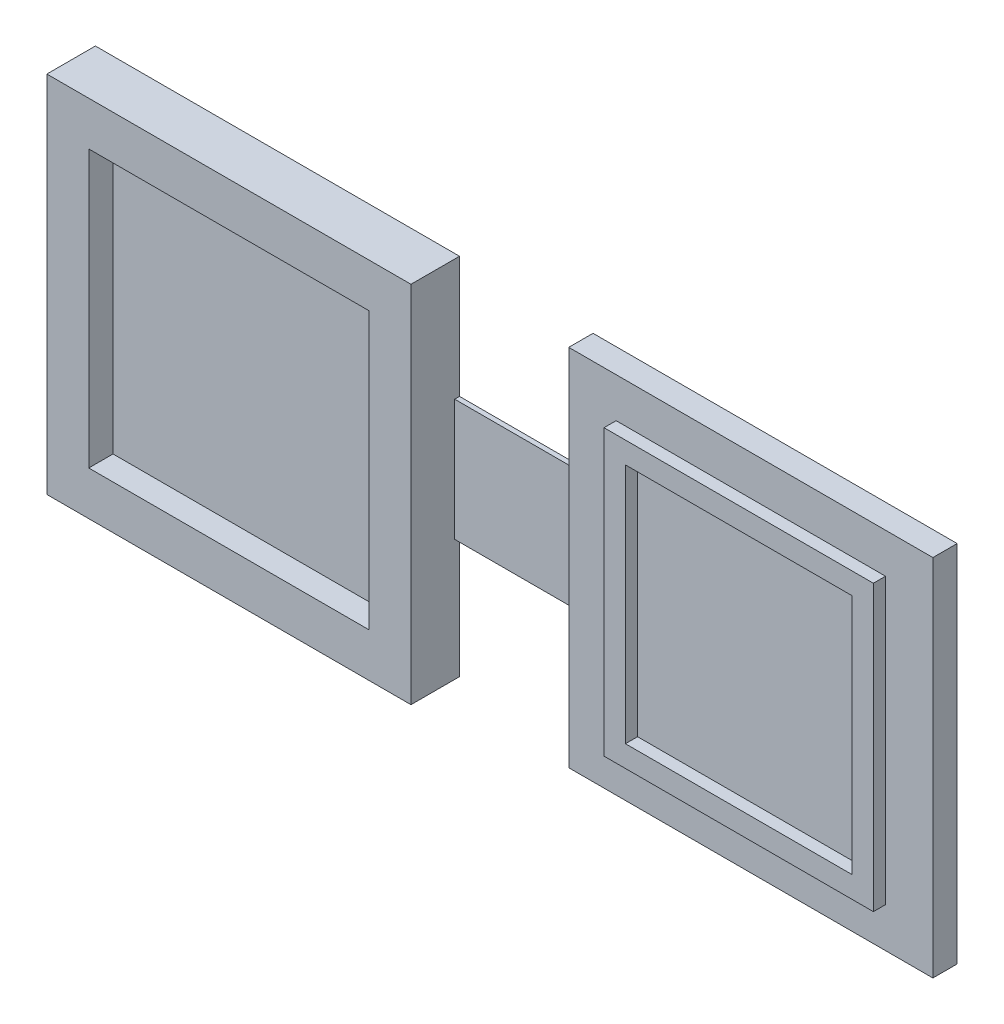
ISO-10303-21;
HEADER;
FILE_DESCRIPTION(('STEP AP214'),'2;1');
FILE_NAME('part.step','',(''),(''),'','','');
FILE_SCHEMA(('AUTOMOTIVE_DESIGN { 1 0 10303 214 1 1 1 1 }'));
ENDSEC;
DATA;
#1=APPLICATION_CONTEXT('core data for automotive mechanical design processes');
#2=APPLICATION_PROTOCOL_DEFINITION('international standard','automotive_design',2000,#1);
#3=PRODUCT_CONTEXT('',#1,'mechanical');
#4=PRODUCT('Part','Part','',(#3));
#5=PRODUCT_RELATED_PRODUCT_CATEGORY('part','',(#4));
#6=PRODUCT_DEFINITION_FORMATION('','',#4);
#7=PRODUCT_DEFINITION_CONTEXT('part definition',#1,'design');
#8=PRODUCT_DEFINITION('design','',#6,#7);
#9=PRODUCT_DEFINITION_SHAPE('','',#8);
#10=(LENGTH_UNIT() NAMED_UNIT(*) SI_UNIT(.MILLI.,.METRE.));
#11=(NAMED_UNIT(*) PLANE_ANGLE_UNIT() SI_UNIT($,.RADIAN.));
#12=(NAMED_UNIT(*) SI_UNIT($,.STERADIAN.) SOLID_ANGLE_UNIT());
#13=UNCERTAINTY_MEASURE_WITH_UNIT(LENGTH_MEASURE(1.E-05),#10,'distance_accuracy_value','');
#14=(GEOMETRIC_REPRESENTATION_CONTEXT(3) GLOBAL_UNCERTAINTY_ASSIGNED_CONTEXT((#13)) GLOBAL_UNIT_ASSIGNED_CONTEXT((#10,
#11,#12)) REPRESENTATION_CONTEXT('',''));
#15=CARTESIAN_POINT('',(0.,0.,0.));
#16=DIRECTION('',(0.,0.,1.));
#17=DIRECTION('',(1.,0.,0.));
#18=AXIS2_PLACEMENT_3D('',#15,#16,#17);
#19=CARTESIAN_POINT('',(-28.8762437670631,0.,2.));
#20=DIRECTION('',(1.,0.,0.));
#21=DIRECTION('',(0.,0.,-1.));
#22=AXIS2_PLACEMENT_3D('',#19,#20,#21);
#23=PLANE('',#22);
#24=DIRECTION('',(0.,0.,-1.));
#25=VECTOR('',#24,1.);
#26=CARTESIAN_POINT('',(-28.8762437670631,1.91304347826088,0.4));
#27=LINE('',#26,#25);
#28=CARTESIAN_POINT('',(-28.8762437670631,1.91304347826088,0.4));
#29=VERTEX_POINT('',#28);
#30=CARTESIAN_POINT('',(-28.8762437670631,1.91304347826088,0.));
#31=VERTEX_POINT('',#30);
#32=EDGE_CURVE('E320',#29,#31,#27,.T.);
#33=ORIENTED_EDGE('',*,*,#32,.F.);
#34=DIRECTION('',(0.,-1.,0.));
#35=VECTOR('',#34,1.);
#36=CARTESIAN_POINT('',(-28.8762437670631,0.,0.4));
#37=LINE('',#36,#35);
#38=CARTESIAN_POINT('',(-28.8762437670631,11.9130434782609,0.4));
#39=VERTEX_POINT('',#38);
#40=EDGE_CURVE('E318',#39,#29,#37,.T.);
#41=ORIENTED_EDGE('',*,*,#40,.F.);
#42=DIRECTION('',(0.,0.,-1.));
#43=VECTOR('',#42,1.);
#44=CARTESIAN_POINT('',(-28.8762437670631,11.9130434782609,0.4));
#45=LINE('',#44,#43);
#46=CARTESIAN_POINT('',(-28.8762437670631,11.9130434782609,0.));
#47=VERTEX_POINT('',#46);
#48=EDGE_CURVE('E325',#39,#47,#45,.T.);
#49=ORIENTED_EDGE('',*,*,#48,.T.);
#50=DIRECTION('',(0.,-1.,0.));
#51=VECTOR('',#50,1.);
#52=CARTESIAN_POINT('',(-28.8762437670631,0.,0.));
#53=LINE('',#52,#51);
#54=CARTESIAN_POINT('',(-28.8762437670631,21.9130434782609,0.));
#55=VERTEX_POINT('',#54);
#56=EDGE_CURVE('E375',#55,#47,#53,.T.);
#57=ORIENTED_EDGE('',*,*,#56,.F.);
#58=DIRECTION('',(0.,0.,-1.));
#59=VECTOR('',#58,1.);
#60=CARTESIAN_POINT('',(-28.8762437670631,21.9130434782609,2.));
#61=LINE('',#60,#59);
#62=CARTESIAN_POINT('',(-28.8762437670631,21.9130434782609,4.));
#63=VERTEX_POINT('',#62);
#64=EDGE_CURVE('E11',#63,#55,#61,.T.);
#65=ORIENTED_EDGE('',*,*,#64,.F.);
#66=DIRECTION('',(0.,-1.,0.));
#67=VECTOR('',#66,1.);
#68=CARTESIAN_POINT('',(-28.8762437670631,0.,4.));
#69=LINE('',#68,#67);
#70=CARTESIAN_POINT('',(-28.8762437670631,-8.08695652173912,4.));
#71=VERTEX_POINT('',#70);
#72=EDGE_CURVE('E341',#63,#71,#69,.T.);
#73=ORIENTED_EDGE('',*,*,#72,.T.);
#74=DIRECTION('',(0.,0.,-1.));
#75=VECTOR('',#74,1.);
#76=CARTESIAN_POINT('',(-28.8762437670631,-8.08695652173912,2.));
#77=LINE('',#76,#75);
#78=CARTESIAN_POINT('',(-28.8762437670631,-8.08695652173912,0.));
#79=VERTEX_POINT('',#78);
#80=EDGE_CURVE('E386',#71,#79,#77,.T.);
#81=ORIENTED_EDGE('',*,*,#80,.T.);
#82=EDGE_CURVE('E374',#31,#79,#53,.T.);
#83=ORIENTED_EDGE('',*,*,#82,.F.);
#84=EDGE_LOOP('',(#33,#41,#49,#57,#65,#73,#81,#83));
#85=FACE_BOUND('',#84,.T.);
#86=ADVANCED_FACE('F39',(#85),#23,.T.);
#87=CARTESIAN_POINT('',(0.,21.9130434782609,2.));
#88=DIRECTION('',(0.,1.,0.));
#89=DIRECTION('',(0.,0.,1.));
#90=AXIS2_PLACEMENT_3D('',#87,#88,#89);
#91=PLANE('',#90);
#92=DIRECTION('',(1.,0.,0.));
#93=VECTOR('',#92,1.);
#94=CARTESIAN_POINT('',(0.,21.9130434782609,0.));
#95=LINE('',#94,#93);
#96=CARTESIAN_POINT('',(-58.8762437670631,21.9130434782609,0.));
#97=VERTEX_POINT('',#96);
#98=EDGE_CURVE('E378',#97,#55,#95,.T.);
#99=ORIENTED_EDGE('',*,*,#98,.F.);
#100=DIRECTION('',(0.,0.,-1.));
#101=VECTOR('',#100,1.);
#102=CARTESIAN_POINT('',(-58.8762437670631,21.9130434782609,2.));
#103=LINE('',#102,#101);
#104=CARTESIAN_POINT('',(-58.8762437670631,21.9130434782609,4.));
#105=VERTEX_POINT('',#104);
#106=EDGE_CURVE('E46',#105,#97,#103,.T.);
#107=ORIENTED_EDGE('',*,*,#106,.F.);
#108=DIRECTION('',(1.,0.,0.));
#109=VECTOR('',#108,1.);
#110=CARTESIAN_POINT('',(0.,21.9130434782609,4.));
#111=LINE('',#110,#109);
#112=EDGE_CURVE('E332',#105,#63,#111,.T.);
#113=ORIENTED_EDGE('',*,*,#112,.T.);
#114=ORIENTED_EDGE('',*,*,#64,.T.);
#115=EDGE_LOOP('',(#99,#107,#113,#114));
#116=FACE_BOUND('',#115,.T.);
#117=ADVANCED_FACE('F401',(#116),#91,.T.);
#118=CARTESIAN_POINT('',(-58.876243767063,0.,2.));
#119=DIRECTION('',(1.,0.,0.));
#120=DIRECTION('',(0.,1.,0.));
#121=AXIS2_PLACEMENT_3D('',#118,#119,#120);
#122=PLANE('',#121);
#123=DIRECTION('',(0.,-1.,0.));
#124=VECTOR('',#123,1.);
#125=CARTESIAN_POINT('',(-58.876243767063,0.,0.));
#126=LINE('',#125,#124);
#127=CARTESIAN_POINT('',(-58.876243767063,-8.08695652173912,0.));
#128=VERTEX_POINT('',#127);
#129=EDGE_CURVE('E381',#97,#128,#126,.T.);
#130=ORIENTED_EDGE('',*,*,#129,.T.);
#131=DIRECTION('',(0.,0.,-1.));
#132=VECTOR('',#131,1.);
#133=CARTESIAN_POINT('',(-58.876243767063,-8.08695652173912,2.));
#134=LINE('',#133,#132);
#135=CARTESIAN_POINT('',(-58.876243767063,-8.08695652173912,4.));
#136=VERTEX_POINT('',#135);
#137=EDGE_CURVE('E389',#136,#128,#134,.T.);
#138=ORIENTED_EDGE('',*,*,#137,.F.);
#139=DIRECTION('',(0.,-1.,0.));
#140=VECTOR('',#139,1.);
#141=CARTESIAN_POINT('',(-58.876243767063,0.,4.));
#142=LINE('',#141,#140);
#143=EDGE_CURVE('E335',#105,#136,#142,.T.);
#144=ORIENTED_EDGE('',*,*,#143,.F.);
#145=ORIENTED_EDGE('',*,*,#106,.T.);
#146=EDGE_LOOP('',(#130,#138,#144,#145));
#147=FACE_BOUND('',#146,.T.);
#148=ADVANCED_FACE('F394',(#147),#122,.F.);
#149=CARTESIAN_POINT('',(0.,-8.08695652173912,2.));
#150=DIRECTION('',(0.,1.,0.));
#151=DIRECTION('',(0.,0.,1.));
#152=AXIS2_PLACEMENT_3D('',#149,#150,#151);
#153=PLANE('',#152);
#154=DIRECTION('',(1.,0.,0.));
#155=VECTOR('',#154,1.);
#156=CARTESIAN_POINT('',(0.,-8.08695652173912,0.));
#157=LINE('',#156,#155);
#158=EDGE_CURVE('E383',#128,#79,#157,.T.);
#159=ORIENTED_EDGE('',*,*,#158,.T.);
#160=ORIENTED_EDGE('',*,*,#80,.F.);
#161=DIRECTION('',(1.,0.,0.));
#162=VECTOR('',#161,1.);
#163=CARTESIAN_POINT('',(0.,-8.08695652173912,4.));
#164=LINE('',#163,#162);
#165=EDGE_CURVE('E338',#136,#71,#164,.T.);
#166=ORIENTED_EDGE('',*,*,#165,.F.);
#167=ORIENTED_EDGE('',*,*,#137,.T.);
#168=EDGE_LOOP('',(#159,#160,#166,#167));
#169=FACE_BOUND('',#168,.T.);
#170=ADVANCED_FACE('F428',(#169),#153,.F.);
#171=CARTESIAN_POINT('',(0.,0.,0.));
#172=DIRECTION('',(0.,0.,1.));
#173=DIRECTION('',(1.,0.,0.));
#174=AXIS2_PLACEMENT_3D('',#171,#172,#173);
#175=PLANE('',#174);
#176=ORIENTED_EDGE('',*,*,#56,.T.);
#177=DIRECTION('',(1.,0.,0.));
#178=VECTOR('',#177,1.);
#179=CARTESIAN_POINT('',(0.,11.9130434782609,0.));
#180=LINE('',#179,#178);
#181=CARTESIAN_POINT('',(-17.8762437670631,11.9130434782609,0.));
#182=VERTEX_POINT('',#181);
#183=EDGE_CURVE('E53',#47,#182,#180,.T.);
#184=ORIENTED_EDGE('',*,*,#183,.T.);
#185=DIRECTION('',(0.,1.,0.));
#186=VECTOR('',#185,1.);
#187=CARTESIAN_POINT('',(-17.8762437670631,0.,0.));
#188=LINE('',#187,#186);
#189=CARTESIAN_POINT('',(-17.876243767063,21.9130434782609,0.));
#190=VERTEX_POINT('',#189);
#191=EDGE_CURVE('E295',#182,#190,#188,.T.);
#192=ORIENTED_EDGE('',*,*,#191,.T.);
#193=DIRECTION('',(1.,0.,0.));
#194=VECTOR('',#193,1.);
#195=CARTESIAN_POINT('',(0.,21.9130434782609,0.));
#196=LINE('',#195,#194);
#197=CARTESIAN_POINT('',(12.1237562329369,21.9130434782609,0.));
#198=VERTEX_POINT('',#197);
#199=EDGE_CURVE('E292',#190,#198,#196,.T.);
#200=ORIENTED_EDGE('',*,*,#199,.T.);
#201=DIRECTION('',(0.,-1.,0.));
#202=VECTOR('',#201,1.);
#203=CARTESIAN_POINT('',(12.1237562329369,0.,0.));
#204=LINE('',#203,#202);
#205=CARTESIAN_POINT('',(12.1237562329369,-8.08695652173912,0.));
#206=VERTEX_POINT('',#205);
#207=EDGE_CURVE('E275',#198,#206,#204,.T.);
#208=ORIENTED_EDGE('',*,*,#207,.T.);
#209=DIRECTION('',(-1.,0.,0.));
#210=VECTOR('',#209,1.);
#211=CARTESIAN_POINT('',(0.,-8.08695652173912,0.));
#212=LINE('',#211,#210);
#213=CARTESIAN_POINT('',(-17.8762437670631,-8.08695652173912,0.));
#214=VERTEX_POINT('',#213);
#215=EDGE_CURVE('E280',#206,#214,#212,.T.);
#216=ORIENTED_EDGE('',*,*,#215,.T.);
#217=CARTESIAN_POINT('',(-17.8762437670631,1.91304347826088,0.));
#218=VERTEX_POINT('',#217);
#219=EDGE_CURVE('E296',#214,#218,#188,.T.);
#220=ORIENTED_EDGE('',*,*,#219,.T.);
#221=DIRECTION('',(-1.,0.,0.));
#222=VECTOR('',#221,1.);
#223=CARTESIAN_POINT('',(0.,1.91304347826088,0.));
#224=LINE('',#223,#222);
#225=EDGE_CURVE('E309',#218,#31,#224,.T.);
#226=ORIENTED_EDGE('',*,*,#225,.T.);
#227=ORIENTED_EDGE('',*,*,#82,.T.);
#228=ORIENTED_EDGE('',*,*,#158,.F.);
#229=ORIENTED_EDGE('',*,*,#129,.F.);
#230=ORIENTED_EDGE('',*,*,#98,.T.);
#231=EDGE_LOOP('',(#176,#184,#192,#200,#208,#216,#220,#226,#227,#228,#229,#230));
#232=FACE_BOUND('',#231,.T.);
#233=ADVANCED_FACE('F400',(#232),#175,.F.);
#234=CARTESIAN_POINT('',(-32.32883156766,0.,4.));
#235=DIRECTION('',(1.,0.,0.));
#236=DIRECTION('',(0.,1.,0.));
#237=AXIS2_PLACEMENT_3D('',#234,#235,#236);
#238=PLANE('',#237);
#239=DIRECTION('',(0.,1.,0.));
#240=VECTOR('',#239,1.);
#241=CARTESIAN_POINT('',(-32.32883156766,0.,2.));
#242=LINE('',#241,#240);
#243=CARTESIAN_POINT('',(-32.32883156766,-4.4703783767008,2.));
#244=VERTEX_POINT('',#243);
#245=CARTESIAN_POINT('',(-32.3288315676601,18.2964653332226,2.));
#246=VERTEX_POINT('',#245);
#247=EDGE_CURVE('E371',#244,#246,#242,.T.);
#248=ORIENTED_EDGE('',*,*,#247,.F.);
#249=DIRECTION('',(0.,0.,-1.));
#250=VECTOR('',#249,1.);
#251=CARTESIAN_POINT('',(-32.32883156766,-4.4703783767008,4.));
#252=LINE('',#251,#250);
#253=CARTESIAN_POINT('',(-32.32883156766,-4.4703783767008,4.));
#254=VERTEX_POINT('',#253);
#255=EDGE_CURVE('E361',#254,#244,#252,.T.);
#256=ORIENTED_EDGE('',*,*,#255,.F.);
#257=DIRECTION('',(0.,-1.,0.));
#258=VECTOR('',#257,1.);
#259=CARTESIAN_POINT('',(-32.32883156766,0.,4.));
#260=LINE('',#259,#258);
#261=CARTESIAN_POINT('',(-32.3288315676601,18.2964653332226,4.));
#262=VERTEX_POINT('',#261);
#263=EDGE_CURVE('E344',#262,#254,#260,.T.);
#264=ORIENTED_EDGE('',*,*,#263,.F.);
#265=DIRECTION('',(0.,0.,-1.));
#266=VECTOR('',#265,1.);
#267=CARTESIAN_POINT('',(-32.3288315676601,18.2964653332226,4.));
#268=LINE('',#267,#266);
#269=EDGE_CURVE('E354',#262,#246,#268,.T.);
#270=ORIENTED_EDGE('',*,*,#269,.T.);
#271=EDGE_LOOP('',(#248,#256,#264,#270));
#272=FACE_BOUND('',#271,.T.);
#273=ADVANCED_FACE('F442',(#272),#238,.F.);
#274=CARTESIAN_POINT('',(0.,-4.4703783767008,4.));
#275=DIRECTION('',(0.,1.,0.));
#276=DIRECTION('',(0.,0.,1.));
#277=AXIS2_PLACEMENT_3D('',#274,#275,#276);
#278=PLANE('',#277);
#279=ORIENTED_EDGE('',*,*,#255,.T.);
#280=DIRECTION('',(-1.,0.,0.));
#281=VECTOR('',#280,1.);
#282=CARTESIAN_POINT('',(0.,-4.4703783767008,2.));
#283=LINE('',#282,#281);
#284=CARTESIAN_POINT('',(-55.4236559664661,-4.4703783767008,2.));
#285=VERTEX_POINT('',#284);
#286=EDGE_CURVE('E369',#244,#285,#283,.T.);
#287=ORIENTED_EDGE('',*,*,#286,.T.);
#288=DIRECTION('',(0.,0.,-1.));
#289=VECTOR('',#288,1.);
#290=CARTESIAN_POINT('',(-55.4236559664661,-4.4703783767008,4.));
#291=LINE('',#290,#289);
#292=CARTESIAN_POINT('',(-55.4236559664661,-4.4703783767008,4.));
#293=VERTEX_POINT('',#292);
#294=EDGE_CURVE('E358',#293,#285,#291,.T.);
#295=ORIENTED_EDGE('',*,*,#294,.F.);
#296=DIRECTION('',(1.,0.,0.));
#297=VECTOR('',#296,1.);
#298=CARTESIAN_POINT('',(0.,-4.4703783767008,4.));
#299=LINE('',#298,#297);
#300=EDGE_CURVE('E346',#293,#254,#299,.T.);
#301=ORIENTED_EDGE('',*,*,#300,.T.);
#302=EDGE_LOOP('',(#279,#287,#295,#301));
#303=FACE_BOUND('',#302,.T.);
#304=ADVANCED_FACE('F445',(#303),#278,.T.);
#305=CARTESIAN_POINT('',(-55.4236559664661,0.,4.));
#306=DIRECTION('',(1.,0.,0.));
#307=DIRECTION('',(0.,0.,-1.));
#308=AXIS2_PLACEMENT_3D('',#305,#306,#307);
#309=PLANE('',#308);
#310=ORIENTED_EDGE('',*,*,#294,.T.);
#311=DIRECTION('',(0.,1.,0.));
#312=VECTOR('',#311,1.);
#313=CARTESIAN_POINT('',(-55.4236559664661,0.,2.));
#314=LINE('',#313,#312);
#315=CARTESIAN_POINT('',(-55.4236559664661,18.2964653332226,2.));
#316=VERTEX_POINT('',#315);
#317=EDGE_CURVE('E367',#285,#316,#314,.T.);
#318=ORIENTED_EDGE('',*,*,#317,.T.);
#319=DIRECTION('',(0.,0.,-1.));
#320=VECTOR('',#319,1.);
#321=CARTESIAN_POINT('',(-55.4236559664661,18.2964653332226,4.));
#322=LINE('',#321,#320);
#323=CARTESIAN_POINT('',(-55.4236559664661,18.2964653332226,4.));
#324=VERTEX_POINT('',#323);
#325=EDGE_CURVE('E61',#324,#316,#322,.T.);
#326=ORIENTED_EDGE('',*,*,#325,.F.);
#327=DIRECTION('',(0.,-1.,0.));
#328=VECTOR('',#327,1.);
#329=CARTESIAN_POINT('',(-55.4236559664661,0.,4.));
#330=LINE('',#329,#328);
#331=EDGE_CURVE('E349',#324,#293,#330,.T.);
#332=ORIENTED_EDGE('',*,*,#331,.T.);
#333=EDGE_LOOP('',(#310,#318,#326,#332));
#334=FACE_BOUND('',#333,.T.);
#335=ADVANCED_FACE('F448',(#334),#309,.T.);
#336=CARTESIAN_POINT('',(0.,18.2964653332226,4.));
#337=DIRECTION('',(0.,1.,0.));
#338=DIRECTION('',(0.,0.,1.));
#339=AXIS2_PLACEMENT_3D('',#336,#337,#338);
#340=PLANE('',#339);
#341=DIRECTION('',(-1.,0.,0.));
#342=VECTOR('',#341,1.);
#343=CARTESIAN_POINT('',(0.,18.2964653332226,2.));
#344=LINE('',#343,#342);
#345=EDGE_CURVE('E364',#246,#316,#344,.T.);
#346=ORIENTED_EDGE('',*,*,#345,.F.);
#347=ORIENTED_EDGE('',*,*,#269,.F.);
#348=DIRECTION('',(1.,0.,0.));
#349=VECTOR('',#348,1.);
#350=CARTESIAN_POINT('',(0.,18.2964653332226,4.));
#351=LINE('',#350,#349);
#352=EDGE_CURVE('E352',#324,#262,#351,.T.);
#353=ORIENTED_EDGE('',*,*,#352,.F.);
#354=ORIENTED_EDGE('',*,*,#325,.T.);
#355=EDGE_LOOP('',(#346,#347,#353,#354));
#356=FACE_BOUND('',#355,.T.);
#357=ADVANCED_FACE('F434',(#356),#340,.F.);
#358=CARTESIAN_POINT('',(0.,0.,4.));
#359=DIRECTION('',(0.,0.,1.));
#360=DIRECTION('',(1.,0.,0.));
#361=AXIS2_PLACEMENT_3D('',#358,#359,#360);
#362=PLANE('',#361);
#363=ORIENTED_EDGE('',*,*,#112,.F.);
#364=ORIENTED_EDGE('',*,*,#143,.T.);
#365=ORIENTED_EDGE('',*,*,#165,.T.);
#366=ORIENTED_EDGE('',*,*,#72,.F.);
#367=EDGE_LOOP('',(#363,#364,#365,#366));
#368=FACE_BOUND('',#367,.T.);
#369=ORIENTED_EDGE('',*,*,#263,.T.);
#370=ORIENTED_EDGE('',*,*,#300,.F.);
#371=ORIENTED_EDGE('',*,*,#331,.F.);
#372=ORIENTED_EDGE('',*,*,#352,.T.);
#373=EDGE_LOOP('',(#369,#370,#371,#372));
#374=FACE_BOUND('',#373,.T.);
#375=ADVANCED_FACE('F430',(#368,#374),#362,.T.);
#376=CARTESIAN_POINT('',(0.,0.,2.));
#377=DIRECTION('',(0.,0.,1.));
#378=DIRECTION('',(1.,0.,0.));
#379=AXIS2_PLACEMENT_3D('',#376,#377,#378);
#380=PLANE('',#379);
#381=ORIENTED_EDGE('',*,*,#286,.F.);
#382=ORIENTED_EDGE('',*,*,#247,.T.);
#383=ORIENTED_EDGE('',*,*,#345,.T.);
#384=ORIENTED_EDGE('',*,*,#317,.F.);
#385=EDGE_LOOP('',(#381,#382,#383,#384));
#386=FACE_BOUND('',#385,.T.);
#387=ADVANCED_FACE('F433',(#386),#380,.T.);
#388=CARTESIAN_POINT('',(0.,1.91304347826088,0.4));
#389=DIRECTION('',(0.,-1.,0.));
#390=DIRECTION('',(1.,0.,0.));
#391=AXIS2_PLACEMENT_3D('',#388,#389,#390);
#392=PLANE('',#391);
#393=ORIENTED_EDGE('',*,*,#225,.F.);
#394=DIRECTION('',(0.,0.,-1.));
#395=VECTOR('',#394,1.);
#396=CARTESIAN_POINT('',(-17.8762437670631,1.91304347826088,0.4));
#397=LINE('',#396,#395);
#398=CARTESIAN_POINT('',(-17.8762437670631,1.91304347826088,0.4));
#399=VERTEX_POINT('',#398);
#400=EDGE_CURVE('E329',#399,#218,#397,.T.);
#401=ORIENTED_EDGE('',*,*,#400,.F.);
#402=DIRECTION('',(-1.,0.,0.));
#403=VECTOR('',#402,1.);
#404=CARTESIAN_POINT('',(0.,1.91304347826088,0.4));
#405=LINE('',#404,#403);
#406=EDGE_CURVE('E310',#399,#29,#405,.T.);
#407=ORIENTED_EDGE('',*,*,#406,.T.);
#408=ORIENTED_EDGE('',*,*,#32,.T.);
#409=EDGE_LOOP('',(#393,#401,#407,#408));
#410=FACE_BOUND('',#409,.T.);
#411=ADVANCED_FACE('F471',(#410),#392,.T.);
#412=CARTESIAN_POINT('',(0.,11.9130434782609,0.4));
#413=DIRECTION('',(0.,1.,0.));
#414=DIRECTION('',(0.,0.,1.));
#415=AXIS2_PLACEMENT_3D('',#412,#413,#414);
#416=PLANE('',#415);
#417=ORIENTED_EDGE('',*,*,#183,.F.);
#418=ORIENTED_EDGE('',*,*,#48,.F.);
#419=DIRECTION('',(1.,0.,0.));
#420=VECTOR('',#419,1.);
#421=CARTESIAN_POINT('',(0.,11.9130434782609,0.4));
#422=LINE('',#421,#420);
#423=CARTESIAN_POINT('',(-17.8762437670631,11.9130434782609,0.4));
#424=VERTEX_POINT('',#423);
#425=EDGE_CURVE('E315',#39,#424,#422,.T.);
#426=ORIENTED_EDGE('',*,*,#425,.T.);
#427=DIRECTION('',(0.,0.,-1.));
#428=VECTOR('',#427,1.);
#429=CARTESIAN_POINT('',(-17.8762437670631,11.9130434782609,0.4));
#430=LINE('',#429,#428);
#431=EDGE_CURVE('E327',#424,#182,#430,.T.);
#432=ORIENTED_EDGE('',*,*,#431,.T.);
#433=EDGE_LOOP('',(#417,#418,#426,#432));
#434=FACE_BOUND('',#433,.T.);
#435=ADVANCED_FACE('F528',(#434),#416,.T.);
#436=CARTESIAN_POINT('',(0.,0.,0.4));
#437=DIRECTION('',(0.,0.,1.));
#438=DIRECTION('',(1.,0.,0.));
#439=AXIS2_PLACEMENT_3D('',#436,#437,#438);
#440=PLANE('',#439);
#441=ORIENTED_EDGE('',*,*,#406,.F.);
#442=DIRECTION('',(0.,1.,0.));
#443=VECTOR('',#442,1.);
#444=CARTESIAN_POINT('',(-17.8762437670631,0.,0.4));
#445=LINE('',#444,#443);
#446=EDGE_CURVE('E313',#399,#424,#445,.T.);
#447=ORIENTED_EDGE('',*,*,#446,.T.);
#448=ORIENTED_EDGE('',*,*,#425,.F.);
#449=ORIENTED_EDGE('',*,*,#40,.T.);
#450=EDGE_LOOP('',(#441,#447,#448,#449));
#451=FACE_BOUND('',#450,.T.);
#452=ADVANCED_FACE('F538',(#451),#440,.T.);
#453=CARTESIAN_POINT('',(-17.8762437670631,0.,2.));
#454=DIRECTION('',(-1.,0.,0.));
#455=DIRECTION('',(0.,-1.,0.));
#456=AXIS2_PLACEMENT_3D('',#453,#454,#455);
#457=PLANE('',#456);
#458=ORIENTED_EDGE('',*,*,#431,.F.);
#459=ORIENTED_EDGE('',*,*,#446,.F.);
#460=ORIENTED_EDGE('',*,*,#400,.T.);
#461=ORIENTED_EDGE('',*,*,#219,.F.);
#462=DIRECTION('',(0.,0.,-1.));
#463=VECTOR('',#462,1.);
#464=CARTESIAN_POINT('',(-17.8762437670631,-8.08695652173912,2.));
#465=LINE('',#464,#463);
#466=CARTESIAN_POINT('',(-17.8762437670631,-8.08695652173912,2.));
#467=VERTEX_POINT('',#466);
#468=EDGE_CURVE('E302',#467,#214,#465,.T.);
#469=ORIENTED_EDGE('',*,*,#468,.F.);
#470=DIRECTION('',(0.,1.,0.));
#471=VECTOR('',#470,1.);
#472=CARTESIAN_POINT('',(-17.8762437670631,0.,2.));
#473=LINE('',#472,#471);
#474=CARTESIAN_POINT('',(-17.876243767063,21.9130434782609,2.));
#475=VERTEX_POINT('',#474);
#476=EDGE_CURVE('E283',#467,#475,#473,.T.);
#477=ORIENTED_EDGE('',*,*,#476,.T.);
#478=DIRECTION('',(0.,0.,-1.));
#479=VECTOR('',#478,1.);
#480=CARTESIAN_POINT('',(-17.876243767063,21.9130434782609,2.));
#481=LINE('',#480,#479);
#482=EDGE_CURVE('E304',#475,#190,#481,.T.);
#483=ORIENTED_EDGE('',*,*,#482,.T.);
#484=ORIENTED_EDGE('',*,*,#191,.F.);
#485=EDGE_LOOP('',(#458,#459,#460,#461,#469,#477,#483,#484));
#486=FACE_BOUND('',#485,.T.);
#487=ADVANCED_FACE('F410',(#486),#457,.T.);
#488=CARTESIAN_POINT('',(12.1237562329369,0.,2.));
#489=DIRECTION('',(1.,0.,0.));
#490=DIRECTION('',(0.,1.,0.));
#491=AXIS2_PLACEMENT_3D('',#488,#489,#490);
#492=PLANE('',#491);
#493=ORIENTED_EDGE('',*,*,#207,.F.);
#494=DIRECTION('',(0.,0.,-1.));
#495=VECTOR('',#494,1.);
#496=CARTESIAN_POINT('',(12.1237562329369,21.9130434782609,2.));
#497=LINE('',#496,#495);
#498=CARTESIAN_POINT('',(12.1237562329369,21.9130434782609,2.));
#499=VERTEX_POINT('',#498);
#500=EDGE_CURVE('E307',#499,#198,#497,.T.);
#501=ORIENTED_EDGE('',*,*,#500,.F.);
#502=DIRECTION('',(0.,-1.,0.));
#503=VECTOR('',#502,1.);
#504=CARTESIAN_POINT('',(12.1237562329369,0.,2.));
#505=LINE('',#504,#503);
#506=CARTESIAN_POINT('',(12.1237562329369,-8.08695652173912,2.));
#507=VERTEX_POINT('',#506);
#508=EDGE_CURVE('E276',#499,#507,#505,.T.);
#509=ORIENTED_EDGE('',*,*,#508,.T.);
#510=DIRECTION('',(0.,0.,-1.));
#511=VECTOR('',#510,1.);
#512=CARTESIAN_POINT('',(12.1237562329369,-8.08695652173912,2.));
#513=LINE('',#512,#511);
#514=EDGE_CURVE('E289',#507,#206,#513,.T.);
#515=ORIENTED_EDGE('',*,*,#514,.T.);
#516=EDGE_LOOP('',(#493,#501,#509,#515));
#517=FACE_BOUND('',#516,.T.);
#518=ADVANCED_FACE('F557',(#517),#492,.T.);
#519=CARTESIAN_POINT('',(0.,21.9130434782609,2.));
#520=DIRECTION('',(0.,1.,0.));
#521=DIRECTION('',(0.,0.,1.));
#522=AXIS2_PLACEMENT_3D('',#519,#520,#521);
#523=PLANE('',#522);
#524=ORIENTED_EDGE('',*,*,#199,.F.);
#525=ORIENTED_EDGE('',*,*,#482,.F.);
#526=DIRECTION('',(1.,0.,0.));
#527=VECTOR('',#526,1.);
#528=CARTESIAN_POINT('',(0.,21.9130434782609,2.));
#529=LINE('',#528,#527);
#530=EDGE_CURVE('E279',#475,#499,#529,.T.);
#531=ORIENTED_EDGE('',*,*,#530,.T.);
#532=ORIENTED_EDGE('',*,*,#500,.T.);
#533=EDGE_LOOP('',(#524,#525,#531,#532));
#534=FACE_BOUND('',#533,.T.);
#535=ADVANCED_FACE('F416',(#534),#523,.T.);
#536=CARTESIAN_POINT('',(0.,-8.08695652173912,2.));
#537=DIRECTION('',(0.,-1.,0.));
#538=DIRECTION('',(1.,0.,0.));
#539=AXIS2_PLACEMENT_3D('',#536,#537,#538);
#540=PLANE('',#539);
#541=ORIENTED_EDGE('',*,*,#215,.F.);
#542=ORIENTED_EDGE('',*,*,#514,.F.);
#543=DIRECTION('',(-1.,0.,0.));
#544=VECTOR('',#543,1.);
#545=CARTESIAN_POINT('',(0.,-8.08695652173912,2.));
#546=LINE('',#545,#544);
#547=EDGE_CURVE('E286',#507,#467,#546,.T.);
#548=ORIENTED_EDGE('',*,*,#547,.T.);
#549=ORIENTED_EDGE('',*,*,#468,.T.);
#550=EDGE_LOOP('',(#541,#542,#548,#549));
#551=FACE_BOUND('',#550,.T.);
#552=ADVANCED_FACE('F421',(#551),#540,.T.);
#553=CARTESIAN_POINT('',(0.,0.,2.));
#554=DIRECTION('',(0.,0.,1.));
#555=DIRECTION('',(1.,0.,0.));
#556=AXIS2_PLACEMENT_3D('',#553,#554,#555);
#557=PLANE('',#556);
#558=DIRECTION('',(-1.,0.,0.));
#559=VECTOR('',#558,1.);
#560=CARTESIAN_POINT('',(0.,18.630045951334,2.));
#561=LINE('',#560,#559);
#562=CARTESIAN_POINT('',(8.22094606099777,18.630045951334,2.));
#563=VERTEX_POINT('',#562);
#564=CARTESIAN_POINT('',(-13.9734335951239,18.630045951334,2.));
#565=VERTEX_POINT('',#564);
#566=EDGE_CURVE('E272',#563,#565,#561,.T.);
#567=ORIENTED_EDGE('',*,*,#566,.F.);
#568=DIRECTION('',(0.,1.,0.));
#569=VECTOR('',#568,1.);
#570=CARTESIAN_POINT('',(8.22094606099777,0.,2.));
#571=LINE('',#570,#569);
#572=CARTESIAN_POINT('',(8.22094606099777,-4.80395899481224,2.));
#573=VERTEX_POINT('',#572);
#574=EDGE_CURVE('E252',#573,#563,#571,.T.);
#575=ORIENTED_EDGE('',*,*,#574,.F.);
#576=DIRECTION('',(-1.,0.,0.));
#577=VECTOR('',#576,1.);
#578=CARTESIAN_POINT('',(0.,-4.80395899481224,2.));
#579=LINE('',#578,#577);
#580=CARTESIAN_POINT('',(-13.9734335951239,-4.80395899481224,2.));
#581=VERTEX_POINT('',#580);
#582=EDGE_CURVE('E268',#573,#581,#579,.T.);
#583=ORIENTED_EDGE('',*,*,#582,.T.);
#584=DIRECTION('',(0.,1.,0.));
#585=VECTOR('',#584,1.);
#586=CARTESIAN_POINT('',(-13.9734335951239,0.,2.));
#587=LINE('',#586,#585);
#588=EDGE_CURVE('E270',#581,#565,#587,.T.);
#589=ORIENTED_EDGE('',*,*,#588,.T.);
#590=EDGE_LOOP('',(#567,#575,#583,#589));
#591=FACE_BOUND('',#590,.T.);
#592=ORIENTED_EDGE('',*,*,#508,.F.);
#593=ORIENTED_EDGE('',*,*,#530,.F.);
#594=ORIENTED_EDGE('',*,*,#476,.F.);
#595=ORIENTED_EDGE('',*,*,#547,.F.);
#596=EDGE_LOOP('',(#592,#593,#594,#595));
#597=FACE_BOUND('',#596,.T.);
#598=ADVANCED_FACE('F584',(#591,#597),#557,.T.);
#599=CARTESIAN_POINT('',(0.,18.630045951334,3.));
#600=DIRECTION('',(0.,1.,0.));
#601=DIRECTION('',(-1.,0.,0.));
#602=AXIS2_PLACEMENT_3D('',#599,#600,#601);
#603=PLANE('',#602);
#604=DIRECTION('',(0.,0.,-1.));
#605=VECTOR('',#604,1.);
#606=CARTESIAN_POINT('',(8.22094606099777,18.630045951334,3.));
#607=LINE('',#606,#605);
#608=CARTESIAN_POINT('',(8.22094606099777,18.630045951334,3.));
#609=VERTEX_POINT('',#608);
#610=EDGE_CURVE('E219',#609,#563,#607,.T.);
#611=ORIENTED_EDGE('',*,*,#610,.T.);
#612=ORIENTED_EDGE('',*,*,#566,.T.);
#613=DIRECTION('',(0.,0.,-1.));
#614=VECTOR('',#613,1.);
#615=CARTESIAN_POINT('',(-13.9734335951239,18.630045951334,3.));
#616=LINE('',#615,#614);
#617=CARTESIAN_POINT('',(-13.9734335951239,18.630045951334,3.));
#618=VERTEX_POINT('',#617);
#619=EDGE_CURVE('E249',#618,#565,#616,.T.);
#620=ORIENTED_EDGE('',*,*,#619,.F.);
#621=DIRECTION('',(1.,0.,0.));
#622=VECTOR('',#621,1.);
#623=CARTESIAN_POINT('',(0.,18.630045951334,3.));
#624=LINE('',#623,#622);
#625=EDGE_CURVE('E229',#618,#609,#624,.T.);
#626=ORIENTED_EDGE('',*,*,#625,.T.);
#627=EDGE_LOOP('',(#611,#612,#620,#626));
#628=FACE_BOUND('',#627,.T.);
#629=ADVANCED_FACE('F593',(#628),#603,.T.);
#630=CARTESIAN_POINT('',(-13.9734335951239,0.,3.));
#631=DIRECTION('',(1.,0.,0.));
#632=DIRECTION('',(0.,1.,0.));
#633=AXIS2_PLACEMENT_3D('',#630,#631,#632);
#634=PLANE('',#633);
#635=ORIENTED_EDGE('',*,*,#588,.F.);
#636=DIRECTION('',(0.,0.,-1.));
#637=VECTOR('',#636,1.);
#638=CARTESIAN_POINT('',(-13.9734335951239,-4.80395899481224,3.));
#639=LINE('',#638,#637);
#640=CARTESIAN_POINT('',(-13.9734335951239,-4.80395899481224,3.));
#641=VERTEX_POINT('',#640);
#642=EDGE_CURVE('E246',#641,#581,#639,.T.);
#643=ORIENTED_EDGE('',*,*,#642,.F.);
#644=DIRECTION('',(0.,-1.,0.));
#645=VECTOR('',#644,1.);
#646=CARTESIAN_POINT('',(-13.9734335951239,0.,3.));
#647=LINE('',#646,#645);
#648=EDGE_CURVE('E232',#618,#641,#647,.T.);
#649=ORIENTED_EDGE('',*,*,#648,.F.);
#650=ORIENTED_EDGE('',*,*,#619,.T.);
#651=EDGE_LOOP('',(#635,#643,#649,#650));
#652=FACE_BOUND('',#651,.T.);
#653=ADVANCED_FACE('F604',(#652),#634,.F.);
#654=CARTESIAN_POINT('',(0.,-4.80395899481224,3.));
#655=DIRECTION('',(0.,1.,0.));
#656=DIRECTION('',(0.,0.,1.));
#657=AXIS2_PLACEMENT_3D('',#654,#655,#656);
#658=PLANE('',#657);
#659=ORIENTED_EDGE('',*,*,#582,.F.);
#660=DIRECTION('',(0.,0.,-1.));
#661=VECTOR('',#660,1.);
#662=CARTESIAN_POINT('',(8.22094606099777,-4.80395899481224,3.));
#663=LINE('',#662,#661);
#664=CARTESIAN_POINT('',(8.22094606099777,-4.80395899481224,3.));
#665=VERTEX_POINT('',#664);
#666=EDGE_CURVE('E243',#665,#573,#663,.T.);
#667=ORIENTED_EDGE('',*,*,#666,.F.);
#668=DIRECTION('',(1.,0.,0.));
#669=VECTOR('',#668,1.);
#670=CARTESIAN_POINT('',(0.,-4.80395899481224,3.));
#671=LINE('',#670,#669);
#672=EDGE_CURVE('E235',#641,#665,#671,.T.);
#673=ORIENTED_EDGE('',*,*,#672,.F.);
#674=ORIENTED_EDGE('',*,*,#642,.T.);
#675=EDGE_LOOP('',(#659,#667,#673,#674));
#676=FACE_BOUND('',#675,.T.);
#677=ADVANCED_FACE('F614',(#676),#658,.F.);
#678=CARTESIAN_POINT('',(6.45317910803141,0.,3.));
#679=DIRECTION('',(1.,0.,0.));
#680=DIRECTION('',(0.,1.,0.));
#681=AXIS2_PLACEMENT_3D('',#678,#679,#680);
#682=PLANE('',#681);
#683=DIRECTION('',(0.,1.,0.));
#684=VECTOR('',#683,1.);
#685=CARTESIAN_POINT('',(6.45317910803141,0.,2.));
#686=LINE('',#685,#684);
#687=CARTESIAN_POINT('',(6.45317910803141,-3.03619204184587,2.));
#688=VERTEX_POINT('',#687);
#689=CARTESIAN_POINT('',(6.4531791080314,16.8622789983676,2.));
#690=VERTEX_POINT('',#689);
#691=EDGE_CURVE('E216',#688,#690,#686,.T.);
#692=ORIENTED_EDGE('',*,*,#691,.F.);
#693=DIRECTION('',(0.,0.,-1.));
#694=VECTOR('',#693,1.);
#695=CARTESIAN_POINT('',(6.45317910803141,-3.03619204184587,3.));
#696=LINE('',#695,#694);
#697=CARTESIAN_POINT('',(6.45317910803141,-3.03619204184587,3.));
#698=VERTEX_POINT('',#697);
#699=EDGE_CURVE('E213',#698,#688,#696,.T.);
#700=ORIENTED_EDGE('',*,*,#699,.F.);
#701=DIRECTION('',(0.,-1.,0.));
#702=VECTOR('',#701,1.);
#703=CARTESIAN_POINT('',(6.45317910803141,0.,3.));
#704=LINE('',#703,#702);
#705=CARTESIAN_POINT('',(6.4531791080314,16.8622789983676,3.));
#706=VERTEX_POINT('',#705);
#707=EDGE_CURVE('E198',#706,#698,#704,.T.);
#708=ORIENTED_EDGE('',*,*,#707,.F.);
#709=DIRECTION('',(0.,0.,-1.));
#710=VECTOR('',#709,1.);
#711=CARTESIAN_POINT('',(6.4531791080314,16.8622789983676,3.));
#712=LINE('',#711,#710);
#713=EDGE_CURVE('E240',#706,#690,#712,.T.);
#714=ORIENTED_EDGE('',*,*,#713,.T.);
#715=EDGE_LOOP('',(#692,#700,#708,#714));
#716=FACE_BOUND('',#715,.T.);
#717=ADVANCED_FACE('F214',(#716),#682,.F.);
#718=CARTESIAN_POINT('',(0.,-3.03619204184587,3.));
#719=DIRECTION('',(0.,1.,0.));
#720=DIRECTION('',(-1.,0.,0.));
#721=AXIS2_PLACEMENT_3D('',#718,#719,#720);
#722=PLANE('',#721);
#723=ORIENTED_EDGE('',*,*,#699,.T.);
#724=DIRECTION('',(-1.,0.,0.));
#725=VECTOR('',#724,1.);
#726=CARTESIAN_POINT('',(0.,-3.03619204184587,2.));
#727=LINE('',#726,#725);
#728=CARTESIAN_POINT('',(-12.2056666421575,-3.03619204184587,2.));
#729=VERTEX_POINT('',#728);
#730=EDGE_CURVE('E265',#688,#729,#727,.T.);
#731=ORIENTED_EDGE('',*,*,#730,.T.);
#732=DIRECTION('',(0.,0.,-1.));
#733=VECTOR('',#732,1.);
#734=CARTESIAN_POINT('',(-12.2056666421575,-3.03619204184587,3.));
#735=LINE('',#734,#733);
#736=CARTESIAN_POINT('',(-12.2056666421575,-3.03619204184587,3.));
#737=VERTEX_POINT('',#736);
#738=EDGE_CURVE('E220',#737,#729,#735,.T.);
#739=ORIENTED_EDGE('',*,*,#738,.F.);
#740=DIRECTION('',(1.,0.,0.));
#741=VECTOR('',#740,1.);
#742=CARTESIAN_POINT('',(0.,-3.03619204184587,3.));
#743=LINE('',#742,#741);
#744=EDGE_CURVE('E204',#737,#698,#743,.T.);
#745=ORIENTED_EDGE('',*,*,#744,.T.);
#746=EDGE_LOOP('',(#723,#731,#739,#745));
#747=FACE_BOUND('',#746,.T.);
#748=ADVANCED_FACE('F222',(#747),#722,.T.);
#749=CARTESIAN_POINT('',(-12.2056666421575,0.,3.));
#750=DIRECTION('',(1.,0.,0.));
#751=DIRECTION('',(0.,1.,0.));
#752=AXIS2_PLACEMENT_3D('',#749,#750,#751);
#753=PLANE('',#752);
#754=ORIENTED_EDGE('',*,*,#738,.T.);
#755=DIRECTION('',(0.,1.,0.));
#756=VECTOR('',#755,1.);
#757=CARTESIAN_POINT('',(-12.2056666421575,0.,2.));
#758=LINE('',#757,#756);
#759=CARTESIAN_POINT('',(-12.2056666421575,16.8622789983676,2.));
#760=VERTEX_POINT('',#759);
#761=EDGE_CURVE('E262',#729,#760,#758,.T.);
#762=ORIENTED_EDGE('',*,*,#761,.T.);
#763=DIRECTION('',(0.,0.,-1.));
#764=VECTOR('',#763,1.);
#765=CARTESIAN_POINT('',(-12.2056666421575,16.8622789983676,3.));
#766=LINE('',#765,#764);
#767=CARTESIAN_POINT('',(-12.2056666421575,16.8622789983676,3.));
#768=VERTEX_POINT('',#767);
#769=EDGE_CURVE('E254',#768,#760,#766,.T.);
#770=ORIENTED_EDGE('',*,*,#769,.F.);
#771=DIRECTION('',(0.,-1.,0.));
#772=VECTOR('',#771,1.);
#773=CARTESIAN_POINT('',(-12.2056666421575,0.,3.));
#774=LINE('',#773,#772);
#775=EDGE_CURVE('E224',#768,#737,#774,.T.);
#776=ORIENTED_EDGE('',*,*,#775,.T.);
#777=EDGE_LOOP('',(#754,#762,#770,#776));
#778=FACE_BOUND('',#777,.T.);
#779=ADVANCED_FACE('F641',(#778),#753,.T.);
#780=CARTESIAN_POINT('',(0.,16.8622789983676,3.));
#781=DIRECTION('',(0.,1.,0.));
#782=DIRECTION('',(0.,0.,1.));
#783=AXIS2_PLACEMENT_3D('',#780,#781,#782);
#784=PLANE('',#783);
#785=DIRECTION('',(-1.,0.,0.));
#786=VECTOR('',#785,1.);
#787=CARTESIAN_POINT('',(0.,16.8622789983676,2.));
#788=LINE('',#787,#786);
#789=EDGE_CURVE('E259',#690,#760,#788,.T.);
#790=ORIENTED_EDGE('',*,*,#789,.F.);
#791=ORIENTED_EDGE('',*,*,#713,.F.);
#792=DIRECTION('',(1.,0.,0.));
#793=VECTOR('',#792,1.);
#794=CARTESIAN_POINT('',(0.,16.8622789983676,3.));
#795=LINE('',#794,#793);
#796=EDGE_CURVE('E207',#768,#706,#795,.T.);
#797=ORIENTED_EDGE('',*,*,#796,.F.);
#798=ORIENTED_EDGE('',*,*,#769,.T.);
#799=EDGE_LOOP('',(#790,#791,#797,#798));
#800=FACE_BOUND('',#799,.T.);
#801=ADVANCED_FACE('F650',(#800),#784,.F.);
#802=CARTESIAN_POINT('',(8.22094606099777,0.,3.));
#803=DIRECTION('',(1.,0.,0.));
#804=DIRECTION('',(0.,1.,0.));
#805=AXIS2_PLACEMENT_3D('',#802,#803,#804);
#806=PLANE('',#805);
#807=ORIENTED_EDGE('',*,*,#666,.T.);
#808=ORIENTED_EDGE('',*,*,#574,.T.);
#809=ORIENTED_EDGE('',*,*,#610,.F.);
#810=DIRECTION('',(0.,-1.,0.));
#811=VECTOR('',#810,1.);
#812=CARTESIAN_POINT('',(8.22094606099777,0.,3.));
#813=LINE('',#812,#811);
#814=EDGE_CURVE('E237',#609,#665,#813,.T.);
#815=ORIENTED_EDGE('',*,*,#814,.T.);
#816=EDGE_LOOP('',(#807,#808,#809,#815));
#817=FACE_BOUND('',#816,.T.);
#818=ADVANCED_FACE('F660',(#817),#806,.T.);
#819=CARTESIAN_POINT('',(0.,0.,3.));
#820=DIRECTION('',(0.,0.,1.));
#821=DIRECTION('',(1.,0.,0.));
#822=AXIS2_PLACEMENT_3D('',#819,#820,#821);
#823=PLANE('',#822);
#824=ORIENTED_EDGE('',*,*,#707,.T.);
#825=ORIENTED_EDGE('',*,*,#744,.F.);
#826=ORIENTED_EDGE('',*,*,#775,.F.);
#827=ORIENTED_EDGE('',*,*,#796,.T.);
#828=EDGE_LOOP('',(#824,#825,#826,#827));
#829=FACE_BOUND('',#828,.T.);
#830=ORIENTED_EDGE('',*,*,#625,.F.);
#831=ORIENTED_EDGE('',*,*,#648,.T.);
#832=ORIENTED_EDGE('',*,*,#672,.T.);
#833=ORIENTED_EDGE('',*,*,#814,.F.);
#834=EDGE_LOOP('',(#830,#831,#832,#833));
#835=FACE_BOUND('',#834,.T.);
#836=ADVANCED_FACE('F200',(#829,#835),#823,.T.);
#837=ORIENTED_EDGE('',*,*,#730,.F.);
#838=ORIENTED_EDGE('',*,*,#691,.T.);
#839=ORIENTED_EDGE('',*,*,#789,.T.);
#840=ORIENTED_EDGE('',*,*,#761,.F.);
#841=EDGE_LOOP('',(#837,#838,#839,#840));
#842=FACE_BOUND('',#841,.T.);
#843=ADVANCED_FACE('F596',(#842),#557,.T.);
#844=CLOSED_SHELL('',(#86,#117,#148,#170,#233,#273,#304,#335,#357,#375,#387,#411,#435,#452,#487,
#518,#535,#552,#598,#629,#653,#677,#717,#748,#779,#801,#818,#836,#843));
#845=MANIFOLD_SOLID_BREP('B2',#844);
#846=ADVANCED_BREP_SHAPE_REPRESENTATION('',(#18,#845),#14);
#847=SHAPE_DEFINITION_REPRESENTATION(#9,#846);
ENDSEC;
END-ISO-10303-21;
